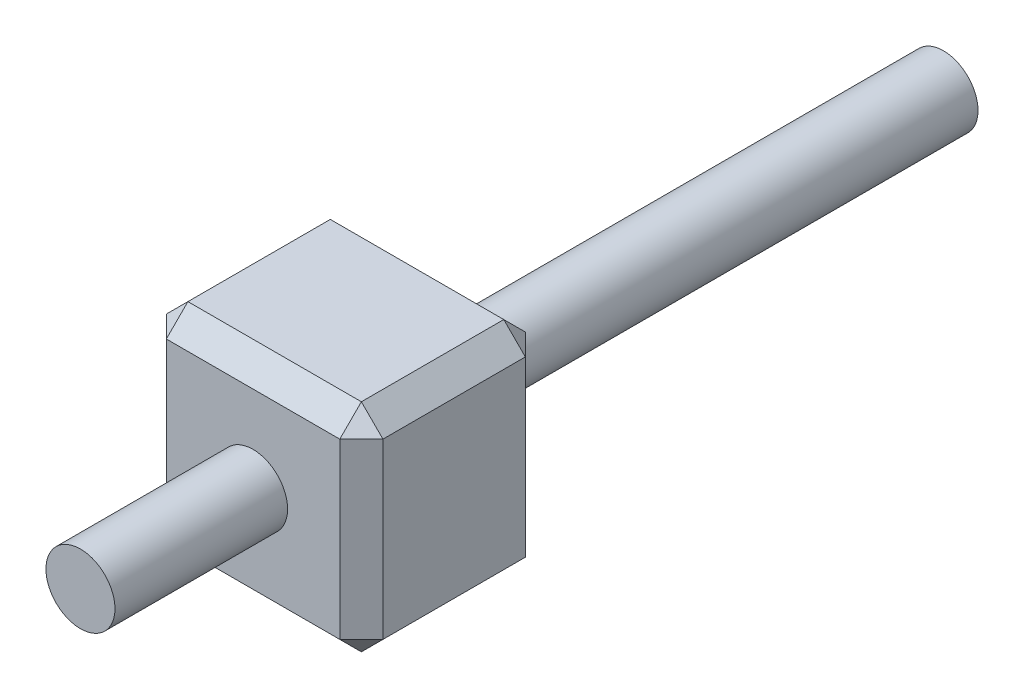
ISO-10303-21;
HEADER;
FILE_DESCRIPTION(('STEP AP214'),'2;1');
FILE_NAME('part.step','',(''),(''),'','','');
FILE_SCHEMA(('AUTOMOTIVE_DESIGN { 1 0 10303 214 1 1 1 1 }'));
ENDSEC;
DATA;
#1=APPLICATION_CONTEXT('core data for automotive mechanical design processes');
#2=APPLICATION_PROTOCOL_DEFINITION('international standard','automotive_design',2000,#1);
#3=PRODUCT_CONTEXT('',#1,'mechanical');
#4=PRODUCT('Part','Part','',(#3));
#5=PRODUCT_RELATED_PRODUCT_CATEGORY('part','',(#4));
#6=PRODUCT_DEFINITION_FORMATION('','',#4);
#7=PRODUCT_DEFINITION_CONTEXT('part definition',#1,'design');
#8=PRODUCT_DEFINITION('design','',#6,#7);
#9=PRODUCT_DEFINITION_SHAPE('','',#8);
#10=(LENGTH_UNIT() NAMED_UNIT(*) SI_UNIT(.MILLI.,.METRE.));
#11=(NAMED_UNIT(*) PLANE_ANGLE_UNIT() SI_UNIT($,.RADIAN.));
#12=(NAMED_UNIT(*) SI_UNIT($,.STERADIAN.) SOLID_ANGLE_UNIT());
#13=UNCERTAINTY_MEASURE_WITH_UNIT(LENGTH_MEASURE(1.E-05),#10,'distance_accuracy_value','');
#14=(GEOMETRIC_REPRESENTATION_CONTEXT(3) GLOBAL_UNCERTAINTY_ASSIGNED_CONTEXT((#13)) GLOBAL_UNIT_ASSIGNED_CONTEXT((#10,
#11,#12)) REPRESENTATION_CONTEXT('',''));
#15=CARTESIAN_POINT('',(0.,0.,0.));
#16=DIRECTION('',(0.,0.,1.));
#17=DIRECTION('',(1.,0.,0.));
#18=AXIS2_PLACEMENT_3D('',#15,#16,#17);
#19=CARTESIAN_POINT('',(-30.5004152134197,21.8097143331672,2.15));
#20=DIRECTION('',(0.,0.,1.));
#21=DIRECTION('',(1.,0.,0.));
#22=AXIS2_PLACEMENT_3D('',#19,#20,#21);
#23=PLANE('',#22);
#24=DIRECTION('',(-1.,0.,0.));
#25=VECTOR('',#24,1.);
#26=CARTESIAN_POINT('',(-30.5004152134197,24.0697143331672,2.15));
#27=LINE('',#26,#25);
#28=CARTESIAN_POINT('',(-28.2404152134197,24.0697143331672,2.15));
#29=VERTEX_POINT('',#28);
#30=CARTESIAN_POINT('',(-30.2504152134197,24.0697143331672,2.15));
#31=VERTEX_POINT('',#30);
#32=EDGE_CURVE('E118',#29,#31,#27,.T.);
#33=ORIENTED_EDGE('',*,*,#32,.T.);
#34=DIRECTION('',(0.,-1.,0.));
#35=VECTOR('',#34,1.);
#36=CARTESIAN_POINT('',(-30.2504152134197,21.8097143331672,2.15));
#37=LINE('',#36,#35);
#38=CARTESIAN_POINT('',(-30.2504152134197,22.0597143331672,2.15));
#39=VERTEX_POINT('',#38);
#40=EDGE_CURVE('E157',#31,#39,#37,.T.);
#41=ORIENTED_EDGE('',*,*,#40,.T.);
#42=DIRECTION('',(1.,0.,0.));
#43=VECTOR('',#42,1.);
#44=CARTESIAN_POINT('',(-27.9904152134197,22.0597143331672,2.15));
#45=LINE('',#44,#43);
#46=CARTESIAN_POINT('',(-28.2404152134197,22.0597143331672,2.15));
#47=VERTEX_POINT('',#46);
#48=EDGE_CURVE('E121',#39,#47,#45,.T.);
#49=ORIENTED_EDGE('',*,*,#48,.T.);
#50=DIRECTION('',(0.,1.,0.));
#51=VECTOR('',#50,1.);
#52=CARTESIAN_POINT('',(-28.2404152134197,24.3197143331672,2.15));
#53=LINE('',#52,#51);
#54=EDGE_CURVE('E113',#47,#29,#53,.T.);
#55=ORIENTED_EDGE('',*,*,#54,.T.);
#56=EDGE_LOOP('',(#33,#41,#49,#55));
#57=FACE_BOUND('',#56,.T.);
#58=CARTESIAN_POINT('',(-29.2454152134197,23.0647143331672,2.15));
#59=DIRECTION('',(0.,0.,1.));
#60=DIRECTION('',(1.,0.,0.));
#61=AXIS2_PLACEMENT_3D('',#58,#59,#60);
#62=CIRCLE('',#61,0.400000000000002);
#63=CARTESIAN_POINT('',(-28.8454152134197,23.0647143331672,2.15));
#64=VERTEX_POINT('',#63);
#65=EDGE_CURVE('E152',#64,#64,#62,.F.);
#66=ORIENTED_EDGE('',*,*,#65,.T.);
#67=EDGE_LOOP('',(#66));
#68=FACE_BOUND('',#67,.T.);
#69=ADVANCED_FACE('F28',(#57,#68),#23,.T.);
#70=CARTESIAN_POINT('',(-30.5004152134197,21.8097143331672,0.));
#71=DIRECTION('',(0.,0.,1.));
#72=DIRECTION('',(1.,0.,0.));
#73=AXIS2_PLACEMENT_3D('',#70,#71,#72);
#74=PLANE('',#73);
#75=DIRECTION('',(-1.,0.,0.));
#76=VECTOR('',#75,1.);
#77=CARTESIAN_POINT('',(-30.5004152134197,22.0597143331672,0.));
#78=LINE('',#77,#76);
#79=CARTESIAN_POINT('',(-28.2404152134197,22.0597143331672,0.));
#80=VERTEX_POINT('',#79);
#81=CARTESIAN_POINT('',(-30.2504152134197,22.0597143331672,0.));
#82=VERTEX_POINT('',#81);
#83=EDGE_CURVE('E172',#80,#82,#78,.T.);
#84=ORIENTED_EDGE('',*,*,#83,.T.);
#85=DIRECTION('',(0.,1.,0.));
#86=VECTOR('',#85,1.);
#87=CARTESIAN_POINT('',(-30.2504152134197,21.8097143331672,0.));
#88=LINE('',#87,#86);
#89=CARTESIAN_POINT('',(-30.2504152134197,24.0697143331672,0.));
#90=VERTEX_POINT('',#89);
#91=EDGE_CURVE('E174',#82,#90,#88,.T.);
#92=ORIENTED_EDGE('',*,*,#91,.T.);
#93=DIRECTION('',(1.,0.,0.));
#94=VECTOR('',#93,1.);
#95=CARTESIAN_POINT('',(-30.5004152134197,24.0697143331672,0.));
#96=LINE('',#95,#94);
#97=CARTESIAN_POINT('',(-28.2404152134197,24.0697143331672,0.));
#98=VERTEX_POINT('',#97);
#99=EDGE_CURVE('E168',#90,#98,#96,.T.);
#100=ORIENTED_EDGE('',*,*,#99,.T.);
#101=DIRECTION('',(0.,-1.,0.));
#102=VECTOR('',#101,1.);
#103=CARTESIAN_POINT('',(-28.2404152134197,21.8097143331672,0.));
#104=LINE('',#103,#102);
#105=EDGE_CURVE('E170',#98,#80,#104,.T.);
#106=ORIENTED_EDGE('',*,*,#105,.T.);
#107=EDGE_LOOP('',(#84,#92,#100,#106));
#108=FACE_BOUND('',#107,.T.);
#109=CARTESIAN_POINT('',(-29.2454152134197,23.0647143331672,0.));
#110=DIRECTION('',(0.,0.,1.));
#111=DIRECTION('',(1.,0.,0.));
#112=AXIS2_PLACEMENT_3D('',#109,#110,#111);
#113=CIRCLE('',#112,0.400000000000002);
#114=CARTESIAN_POINT('',(-28.8454152134197,23.0647143331672,0.));
#115=VERTEX_POINT('',#114);
#116=EDGE_CURVE('E149',#115,#115,#113,.F.);
#117=ORIENTED_EDGE('',*,*,#116,.F.);
#118=EDGE_LOOP('',(#117));
#119=FACE_BOUND('',#118,.T.);
#120=ADVANCED_FACE('F290',(#108,#119),#74,.F.);
#121=CARTESIAN_POINT('',(-30.5004152134197,24.3197143331672,2.15));
#122=DIRECTION('',(1.,0.,0.));
#123=DIRECTION('',(0.,0.,-1.));
#124=AXIS2_PLACEMENT_3D('',#121,#122,#123);
#125=PLANE('',#124);
#126=DIRECTION('',(0.,-1.,0.));
#127=VECTOR('',#126,1.);
#128=CARTESIAN_POINT('',(-30.5004152134197,24.3197143331672,0.25));
#129=LINE('',#128,#127);
#130=CARTESIAN_POINT('',(-30.5004152134197,24.0697143331672,0.25));
#131=VERTEX_POINT('',#130);
#132=CARTESIAN_POINT('',(-30.5004152134197,22.0597143331672,0.25));
#133=VERTEX_POINT('',#132);
#134=EDGE_CURVE('E161',#131,#133,#129,.T.);
#135=ORIENTED_EDGE('',*,*,#134,.T.);
#136=DIRECTION('',(0.,0.,1.));
#137=VECTOR('',#136,1.);
#138=CARTESIAN_POINT('',(-30.5004152134197,22.0597143331672,2.15));
#139=LINE('',#138,#137);
#140=CARTESIAN_POINT('',(-30.5004152134197,22.0597143331672,1.9));
#141=VERTEX_POINT('',#140);
#142=EDGE_CURVE('E166',#133,#141,#139,.T.);
#143=ORIENTED_EDGE('',*,*,#142,.T.);
#144=DIRECTION('',(0.,1.,0.));
#145=VECTOR('',#144,1.);
#146=CARTESIAN_POINT('',(-30.5004152134197,24.3197143331672,1.9));
#147=LINE('',#146,#145);
#148=CARTESIAN_POINT('',(-30.5004152134197,24.0697143331672,1.9));
#149=VERTEX_POINT('',#148);
#150=EDGE_CURVE('E163',#141,#149,#147,.T.);
#151=ORIENTED_EDGE('',*,*,#150,.T.);
#152=DIRECTION('',(0.,0.,-1.));
#153=VECTOR('',#152,1.);
#154=CARTESIAN_POINT('',(-30.5004152134197,24.0697143331672,2.15));
#155=LINE('',#154,#153);
#156=EDGE_CURVE('E159',#149,#131,#155,.T.);
#157=ORIENTED_EDGE('',*,*,#156,.T.);
#158=EDGE_LOOP('',(#135,#143,#151,#157));
#159=FACE_BOUND('',#158,.T.);
#160=ADVANCED_FACE('F30',(#159),#125,.F.);
#161=CARTESIAN_POINT('',(-30.5004152134197,21.8097143331672,2.15));
#162=DIRECTION('',(0.,1.,0.));
#163=DIRECTION('',(0.,0.,1.));
#164=AXIS2_PLACEMENT_3D('',#161,#162,#163);
#165=PLANE('',#164);
#166=DIRECTION('',(-1.,0.,0.));
#167=VECTOR('',#166,1.);
#168=CARTESIAN_POINT('',(-30.5004152134197,21.8097143331672,1.9));
#169=LINE('',#168,#167);
#170=CARTESIAN_POINT('',(-28.2404152134197,21.8097143331672,1.9));
#171=VERTEX_POINT('',#170);
#172=CARTESIAN_POINT('',(-30.2504152134197,21.8097143331672,1.9));
#173=VERTEX_POINT('',#172);
#174=EDGE_CURVE('E181',#171,#173,#169,.T.);
#175=ORIENTED_EDGE('',*,*,#174,.T.);
#176=DIRECTION('',(0.,0.,-1.));
#177=VECTOR('',#176,1.);
#178=CARTESIAN_POINT('',(-30.2504152134197,21.8097143331672,2.15));
#179=LINE('',#178,#177);
#180=CARTESIAN_POINT('',(-30.2504152134197,21.8097143331672,0.25));
#181=VERTEX_POINT('',#180);
#182=EDGE_CURVE('E183',#173,#181,#179,.T.);
#183=ORIENTED_EDGE('',*,*,#182,.T.);
#184=DIRECTION('',(1.,0.,0.));
#185=VECTOR('',#184,1.);
#186=CARTESIAN_POINT('',(-30.5004152134197,21.8097143331672,0.25));
#187=LINE('',#186,#185);
#188=CARTESIAN_POINT('',(-28.2404152134197,21.8097143331672,0.25));
#189=VERTEX_POINT('',#188);
#190=EDGE_CURVE('E179',#181,#189,#187,.T.);
#191=ORIENTED_EDGE('',*,*,#190,.T.);
#192=DIRECTION('',(0.,0.,1.));
#193=VECTOR('',#192,1.);
#194=CARTESIAN_POINT('',(-28.2404152134197,21.8097143331672,2.15));
#195=LINE('',#194,#193);
#196=EDGE_CURVE('E177',#189,#171,#195,.T.);
#197=ORIENTED_EDGE('',*,*,#196,.T.);
#198=EDGE_LOOP('',(#175,#183,#191,#197));
#199=FACE_BOUND('',#198,.T.);
#200=ADVANCED_FACE('F303',(#199),#165,.F.);
#201=CARTESIAN_POINT('',(-27.9904152134197,24.3197143331672,2.15));
#202=DIRECTION('',(-1.,0.,0.));
#203=DIRECTION('',(0.,-1.,0.));
#204=AXIS2_PLACEMENT_3D('',#201,#202,#203);
#205=PLANE('',#204);
#206=DIRECTION('',(0.,-1.,0.));
#207=VECTOR('',#206,1.);
#208=CARTESIAN_POINT('',(-27.9904152134197,21.8097143331672,1.9));
#209=LINE('',#208,#207);
#210=CARTESIAN_POINT('',(-27.9904152134197,24.0697143331672,1.9));
#211=VERTEX_POINT('',#210);
#212=CARTESIAN_POINT('',(-27.9904152134197,22.0597143331672,1.9));
#213=VERTEX_POINT('',#212);
#214=EDGE_CURVE('E131',#211,#213,#209,.T.);
#215=ORIENTED_EDGE('',*,*,#214,.T.);
#216=DIRECTION('',(0.,0.,-1.));
#217=VECTOR('',#216,1.);
#218=CARTESIAN_POINT('',(-27.9904152134197,22.0597143331672,2.15));
#219=LINE('',#218,#217);
#220=CARTESIAN_POINT('',(-27.9904152134197,22.0597143331672,0.25));
#221=VERTEX_POINT('',#220);
#222=EDGE_CURVE('E191',#213,#221,#219,.T.);
#223=ORIENTED_EDGE('',*,*,#222,.T.);
#224=DIRECTION('',(0.,1.,0.));
#225=VECTOR('',#224,1.);
#226=CARTESIAN_POINT('',(-27.9904152134197,24.3197143331672,0.25));
#227=LINE('',#226,#225);
#228=CARTESIAN_POINT('',(-27.9904152134197,24.0697143331672,0.25));
#229=VERTEX_POINT('',#228);
#230=EDGE_CURVE('E188',#221,#229,#227,.T.);
#231=ORIENTED_EDGE('',*,*,#230,.T.);
#232=DIRECTION('',(0.,0.,1.));
#233=VECTOR('',#232,1.);
#234=CARTESIAN_POINT('',(-27.9904152134197,24.0697143331672,2.15));
#235=LINE('',#234,#233);
#236=EDGE_CURVE('E186',#229,#211,#235,.T.);
#237=ORIENTED_EDGE('',*,*,#236,.T.);
#238=EDGE_LOOP('',(#215,#223,#231,#237));
#239=FACE_BOUND('',#238,.T.);
#240=ADVANCED_FACE('F301',(#239),#205,.F.);
#241=CARTESIAN_POINT('',(-30.5004152134197,24.3197143331672,2.15));
#242=DIRECTION('',(0.,-1.,0.));
#243=DIRECTION('',(0.,0.,-1.));
#244=AXIS2_PLACEMENT_3D('',#241,#242,#243);
#245=PLANE('',#244);
#246=DIRECTION('',(1.,0.,0.));
#247=VECTOR('',#246,1.);
#248=CARTESIAN_POINT('',(-27.9904152134197,24.3197143331672,1.9));
#249=LINE('',#248,#247);
#250=CARTESIAN_POINT('',(-30.2504152134197,24.3197143331672,1.9));
#251=VERTEX_POINT('',#250);
#252=CARTESIAN_POINT('',(-28.2404152134197,24.3197143331672,1.9));
#253=VERTEX_POINT('',#252);
#254=EDGE_CURVE('E36',#251,#253,#249,.T.);
#255=ORIENTED_EDGE('',*,*,#254,.T.);
#256=DIRECTION('',(0.,0.,-1.));
#257=VECTOR('',#256,1.);
#258=CARTESIAN_POINT('',(-28.2404152134197,24.3197143331672,2.15));
#259=LINE('',#258,#257);
#260=CARTESIAN_POINT('',(-28.2404152134197,24.3197143331672,0.25));
#261=VERTEX_POINT('',#260);
#262=EDGE_CURVE('E11',#253,#261,#259,.T.);
#263=ORIENTED_EDGE('',*,*,#262,.T.);
#264=DIRECTION('',(-1.,0.,0.));
#265=VECTOR('',#264,1.);
#266=CARTESIAN_POINT('',(-30.5004152134197,24.3197143331672,0.25));
#267=LINE('',#266,#265);
#268=CARTESIAN_POINT('',(-30.2504152134197,24.3197143331672,0.25));
#269=VERTEX_POINT('',#268);
#270=EDGE_CURVE('E194',#261,#269,#267,.T.);
#271=ORIENTED_EDGE('',*,*,#270,.T.);
#272=DIRECTION('',(0.,0.,1.));
#273=VECTOR('',#272,1.);
#274=CARTESIAN_POINT('',(-30.2504152134197,24.3197143331672,2.15));
#275=LINE('',#274,#273);
#276=EDGE_CURVE('E46',#269,#251,#275,.T.);
#277=ORIENTED_EDGE('',*,*,#276,.T.);
#278=EDGE_LOOP('',(#255,#263,#271,#277));
#279=FACE_BOUND('',#278,.T.);
#280=ADVANCED_FACE('F197',(#279),#245,.F.);
#281=CARTESIAN_POINT('',(-29.2454152134197,23.0647143331672,-5.85));
#282=DIRECTION('',(0.,0.,1.));
#283=DIRECTION('',(1.,0.,0.));
#284=AXIS2_PLACEMENT_3D('',#281,#282,#283);
#285=PLANE('',#284);
#286=CARTESIAN_POINT('',(-29.2454152134197,23.0647143331672,-5.85));
#287=DIRECTION('',(0.,0.,1.));
#288=DIRECTION('',(1.,0.,0.));
#289=AXIS2_PLACEMENT_3D('',#286,#287,#288);
#290=CIRCLE('',#289,0.400000000000002);
#291=CARTESIAN_POINT('',(-28.8454152134197,23.0647143331672,-5.85));
#292=VERTEX_POINT('',#291);
#293=EDGE_CURVE('E263',#292,#292,#290,.T.);
#294=ORIENTED_EDGE('',*,*,#293,.F.);
#295=EDGE_LOOP('',(#294));
#296=FACE_BOUND('',#295,.T.);
#297=ADVANCED_FACE('F300',(#296),#285,.F.);
#298=CARTESIAN_POINT('',(-29.2454152134197,23.0647143331672,4.15));
#299=DIRECTION('',(0.,0.,-1.));
#300=DIRECTION('',(-1.,0.,0.));
#301=AXIS2_PLACEMENT_3D('',#298,#299,#300);
#302=CYLINDRICAL_SURFACE('',#301,0.400000000000002);
#303=ORIENTED_EDGE('',*,*,#293,.T.);
#304=EDGE_LOOP('',(#303));
#305=FACE_BOUND('',#304,.T.);
#306=ORIENTED_EDGE('',*,*,#116,.T.);
#307=EDGE_LOOP('',(#306));
#308=FACE_BOUND('',#307,.T.);
#309=ADVANCED_FACE('F275',(#305,#308),#302,.T.);
#310=ORIENTED_EDGE('',*,*,#65,.F.);
#311=EDGE_LOOP('',(#310));
#312=FACE_BOUND('',#311,.T.);
#313=CARTESIAN_POINT('',(-29.2454152134197,23.0647143331672,4.15));
#314=DIRECTION('',(0.,0.,1.));
#315=DIRECTION('',(1.,0.,0.));
#316=AXIS2_PLACEMENT_3D('',#313,#314,#315);
#317=CIRCLE('',#316,0.400000000000002);
#318=CARTESIAN_POINT('',(-28.8454152134197,23.0647143331672,4.15));
#319=VERTEX_POINT('',#318);
#320=EDGE_CURVE('E266',#319,#319,#317,.T.);
#321=ORIENTED_EDGE('',*,*,#320,.F.);
#322=EDGE_LOOP('',(#321));
#323=FACE_BOUND('',#322,.T.);
#324=ADVANCED_FACE('F271',(#312,#323),#302,.T.);
#325=CARTESIAN_POINT('',(-29.2454152134197,23.0647143331672,4.15));
#326=DIRECTION('',(0.,0.,1.));
#327=DIRECTION('',(1.,0.,0.));
#328=AXIS2_PLACEMENT_3D('',#325,#326,#327);
#329=PLANE('',#328);
#330=ORIENTED_EDGE('',*,*,#320,.T.);
#331=EDGE_LOOP('',(#330));
#332=FACE_BOUND('',#331,.T.);
#333=ADVANCED_FACE('F274',(#332),#329,.T.);
#334=CARTESIAN_POINT('',(-27.9904152134197,24.3197143331672,0.25));
#335=DIRECTION('',(-0.707106781186547,0.,0.707106781186547));
#336=DIRECTION('',(0.707106781186548,0.,0.707106781186548));
#337=AXIS2_PLACEMENT_3D('',#334,#335,#336);
#338=PLANE('',#337);
#339=DIRECTION('',(0.707106781186548,0.,0.707106781186548));
#340=VECTOR('',#339,1.);
#341=CARTESIAN_POINT('',(-27.9904152134197,24.0697143331672,0.25));
#342=LINE('',#341,#340);
#343=EDGE_CURVE('E260',#229,#98,#342,.F.);
#344=ORIENTED_EDGE('',*,*,#343,.F.);
#345=ORIENTED_EDGE('',*,*,#230,.F.);
#346=DIRECTION('',(-0.707106781186547,0.,-0.707106781186547));
#347=VECTOR('',#346,1.);
#348=CARTESIAN_POINT('',(-28.1154152134197,22.0597143331672,0.125));
#349=LINE('',#348,#347);
#350=EDGE_CURVE('E257',#80,#221,#349,.F.);
#351=ORIENTED_EDGE('',*,*,#350,.F.);
#352=ORIENTED_EDGE('',*,*,#105,.F.);
#353=EDGE_LOOP('',(#344,#345,#351,#352));
#354=FACE_BOUND('',#353,.T.);
#355=ADVANCED_FACE('F280',(#354),#338,.F.);
#356=CARTESIAN_POINT('',(-27.9904152134197,24.0697143331672,0.25));
#357=DIRECTION('',(0.577350269189626,0.577350269189626,-0.577350269189626));
#358=DIRECTION('',(-0.707106781186547,0.,-0.707106781186547));
#359=AXIS2_PLACEMENT_3D('',#356,#357,#358);
#360=PLANE('',#359);
#361=DIRECTION('',(-0.707106781186547,0.707106781186547,0.));
#362=VECTOR('',#361,1.);
#363=CARTESIAN_POINT('',(-27.9904152134197,24.0697143331672,0.25));
#364=LINE('',#363,#362);
#365=EDGE_CURVE('E252',#229,#261,#364,.T.);
#366=ORIENTED_EDGE('',*,*,#365,.F.);
#367=ORIENTED_EDGE('',*,*,#343,.T.);
#368=DIRECTION('',(0.,-0.707106781186547,-0.707106781186547));
#369=VECTOR('',#368,1.);
#370=CARTESIAN_POINT('',(-28.2404152134197,24.1947143331672,0.125));
#371=LINE('',#370,#369);
#372=EDGE_CURVE('E255',#261,#98,#371,.T.);
#373=ORIENTED_EDGE('',*,*,#372,.F.);
#374=EDGE_LOOP('',(#366,#367,#373));
#375=FACE_BOUND('',#374,.T.);
#376=ADVANCED_FACE('F286',(#375),#360,.T.);
#377=CARTESIAN_POINT('',(-28.2404152134197,21.8097143331672,0.25));
#378=DIRECTION('',(0.577350269189626,-0.577350269189626,-0.577350269189626));
#379=DIRECTION('',(-0.707106781186547,0.,-0.707106781186547));
#380=AXIS2_PLACEMENT_3D('',#377,#378,#379);
#381=PLANE('',#380);
#382=DIRECTION('',(0.,-0.707106781186547,0.707106781186547));
#383=VECTOR('',#382,1.);
#384=CARTESIAN_POINT('',(-28.2404152134197,21.8097143331672,0.25));
#385=LINE('',#384,#383);
#386=EDGE_CURVE('E247',#80,#189,#385,.T.);
#387=ORIENTED_EDGE('',*,*,#386,.F.);
#388=ORIENTED_EDGE('',*,*,#350,.T.);
#389=DIRECTION('',(0.707106781186547,0.707106781186547,0.));
#390=VECTOR('',#389,1.);
#391=CARTESIAN_POINT('',(-28.2404152134197,21.8097143331672,0.25));
#392=LINE('',#391,#390);
#393=EDGE_CURVE('E250',#189,#221,#392,.T.);
#394=ORIENTED_EDGE('',*,*,#393,.F.);
#395=EDGE_LOOP('',(#387,#388,#394));
#396=FACE_BOUND('',#395,.T.);
#397=ADVANCED_FACE('F348',(#396),#381,.T.);
#398=CARTESIAN_POINT('',(-30.5004152134197,24.3197143331672,0.25));
#399=DIRECTION('',(0.,-0.707106781186547,0.707106781186547));
#400=DIRECTION('',(0.,-0.707106781186548,-0.707106781186548));
#401=AXIS2_PLACEMENT_3D('',#398,#399,#400);
#402=PLANE('',#401);
#403=ORIENTED_EDGE('',*,*,#372,.T.);
#404=ORIENTED_EDGE('',*,*,#99,.F.);
#405=DIRECTION('',(0.,0.707106781186547,0.707106781186547));
#406=VECTOR('',#405,1.);
#407=CARTESIAN_POINT('',(-30.2504152134197,24.0697143331672,0.));
#408=LINE('',#407,#406);
#409=EDGE_CURVE('E202',#269,#90,#408,.F.);
#410=ORIENTED_EDGE('',*,*,#409,.F.);
#411=ORIENTED_EDGE('',*,*,#270,.F.);
#412=EDGE_LOOP('',(#403,#404,#410,#411));
#413=FACE_BOUND('',#412,.T.);
#414=ADVANCED_FACE('F204',(#413),#402,.F.);
#415=CARTESIAN_POINT('',(-28.2404152134197,24.3197143331672,2.15));
#416=DIRECTION('',(-0.707106781186547,-0.707106781186547,0.));
#417=DIRECTION('',(0.707106781186548,-0.707106781186548,0.));
#418=AXIS2_PLACEMENT_3D('',#415,#416,#417);
#419=PLANE('',#418);
#420=ORIENTED_EDGE('',*,*,#365,.T.);
#421=ORIENTED_EDGE('',*,*,#262,.F.);
#422=DIRECTION('',(0.707106781186547,-0.707106781186547,0.));
#423=VECTOR('',#422,1.);
#424=CARTESIAN_POINT('',(-28.1154152134197,24.1947143331672,1.9));
#425=LINE('',#424,#423);
#426=EDGE_CURVE('E135',#211,#253,#425,.F.);
#427=ORIENTED_EDGE('',*,*,#426,.F.);
#428=ORIENTED_EDGE('',*,*,#236,.F.);
#429=EDGE_LOOP('',(#420,#421,#427,#428));
#430=FACE_BOUND('',#429,.T.);
#431=ADVANCED_FACE('F377',(#430),#419,.F.);
#432=CARTESIAN_POINT('',(-28.2404152134197,21.8097143331672,2.15));
#433=DIRECTION('',(0.707106781186547,0.,0.707106781186547));
#434=DIRECTION('',(0.707106781186548,0.,-0.707106781186548));
#435=AXIS2_PLACEMENT_3D('',#432,#433,#434);
#436=PLANE('',#435);
#437=DIRECTION('',(-0.707106781186547,0.,0.707106781186547));
#438=VECTOR('',#437,1.);
#439=CARTESIAN_POINT('',(-28.2404152134197,22.0597143331672,2.15));
#440=LINE('',#439,#438);
#441=EDGE_CURVE('E136',#213,#47,#440,.T.);
#442=ORIENTED_EDGE('',*,*,#441,.F.);
#443=ORIENTED_EDGE('',*,*,#214,.F.);
#444=DIRECTION('',(0.707106781186548,0.,-0.707106781186548));
#445=VECTOR('',#444,1.);
#446=CARTESIAN_POINT('',(-28.2404152134197,24.0697143331672,2.15));
#447=LINE('',#446,#445);
#448=EDGE_CURVE('E128',#29,#211,#447,.T.);
#449=ORIENTED_EDGE('',*,*,#448,.F.);
#450=ORIENTED_EDGE('',*,*,#54,.F.);
#451=EDGE_LOOP('',(#442,#443,#449,#450));
#452=FACE_BOUND('',#451,.T.);
#453=ADVANCED_FACE('F130',(#452),#436,.T.);
#454=CARTESIAN_POINT('',(-27.9904152134197,22.0597143331672,2.15));
#455=DIRECTION('',(-0.707106781186547,0.707106781186547,0.));
#456=DIRECTION('',(-0.707106781186548,-0.707106781186548,0.));
#457=AXIS2_PLACEMENT_3D('',#454,#455,#456);
#458=PLANE('',#457);
#459=ORIENTED_EDGE('',*,*,#393,.T.);
#460=ORIENTED_EDGE('',*,*,#222,.F.);
#461=DIRECTION('',(-0.707106781186547,-0.707106781186547,0.));
#462=VECTOR('',#461,1.);
#463=CARTESIAN_POINT('',(-28.1154152134197,21.9347143331672,1.9));
#464=LINE('',#463,#462);
#465=EDGE_CURVE('E241',#171,#213,#464,.F.);
#466=ORIENTED_EDGE('',*,*,#465,.F.);
#467=ORIENTED_EDGE('',*,*,#196,.F.);
#468=EDGE_LOOP('',(#459,#460,#466,#467));
#469=FACE_BOUND('',#468,.T.);
#470=ADVANCED_FACE('F353',(#469),#458,.F.);
#471=CARTESIAN_POINT('',(-30.5004152134197,21.8097143331672,0.25));
#472=DIRECTION('',(0.,0.707106781186547,0.707106781186547));
#473=DIRECTION('',(0.,-0.707106781186548,0.707106781186548));
#474=AXIS2_PLACEMENT_3D('',#471,#472,#473);
#475=PLANE('',#474);
#476=ORIENTED_EDGE('',*,*,#386,.T.);
#477=ORIENTED_EDGE('',*,*,#190,.F.);
#478=DIRECTION('',(0.,0.707106781186547,-0.707106781186547));
#479=VECTOR('',#478,1.);
#480=CARTESIAN_POINT('',(-30.2504152134197,21.9347143331672,0.125));
#481=LINE('',#480,#479);
#482=EDGE_CURVE('E238',#82,#181,#481,.F.);
#483=ORIENTED_EDGE('',*,*,#482,.F.);
#484=ORIENTED_EDGE('',*,*,#83,.F.);
#485=EDGE_LOOP('',(#476,#477,#483,#484));
#486=FACE_BOUND('',#485,.T.);
#487=ADVANCED_FACE('F344',(#486),#475,.F.);
#488=CARTESIAN_POINT('',(-30.5004152134197,24.3197143331672,0.25));
#489=DIRECTION('',(0.707106781186547,0.,0.707106781186547));
#490=DIRECTION('',(0.707106781186548,0.,-0.707106781186548));
#491=AXIS2_PLACEMENT_3D('',#488,#489,#490);
#492=PLANE('',#491);
#493=DIRECTION('',(0.707106781186547,0.,-0.707106781186547));
#494=VECTOR('',#493,1.);
#495=CARTESIAN_POINT('',(-30.2504152134197,24.0697143331672,0.));
#496=LINE('',#495,#494);
#497=EDGE_CURVE('E208',#90,#131,#496,.F.);
#498=ORIENTED_EDGE('',*,*,#497,.F.);
#499=ORIENTED_EDGE('',*,*,#91,.F.);
#500=DIRECTION('',(-0.707106781186547,0.,0.707106781186547));
#501=VECTOR('',#500,1.);
#502=CARTESIAN_POINT('',(-30.5004152134197,22.0597143331672,0.25));
#503=LINE('',#502,#501);
#504=EDGE_CURVE('E214',#133,#82,#503,.F.);
#505=ORIENTED_EDGE('',*,*,#504,.F.);
#506=ORIENTED_EDGE('',*,*,#134,.F.);
#507=EDGE_LOOP('',(#498,#499,#505,#506));
#508=FACE_BOUND('',#507,.T.);
#509=ADVANCED_FACE('F337',(#508),#492,.F.);
#510=CARTESIAN_POINT('',(-30.2504152134197,24.0697143331672,0.));
#511=DIRECTION('',(-0.577350269189626,0.577350269189626,-0.577350269189626));
#512=DIRECTION('',(-0.707106781186547,0.,0.707106781186547));
#513=AXIS2_PLACEMENT_3D('',#510,#511,#512);
#514=PLANE('',#513);
#515=ORIENTED_EDGE('',*,*,#409,.T.);
#516=ORIENTED_EDGE('',*,*,#497,.T.);
#517=DIRECTION('',(-0.707106781186547,-0.707106781186547,0.));
#518=VECTOR('',#517,1.);
#519=CARTESIAN_POINT('',(-30.3754152134197,24.1947143331672,0.25));
#520=LINE('',#519,#518);
#521=EDGE_CURVE('E142',#269,#131,#520,.T.);
#522=ORIENTED_EDGE('',*,*,#521,.F.);
#523=EDGE_LOOP('',(#515,#516,#522));
#524=FACE_BOUND('',#523,.T.);
#525=ADVANCED_FACE('F211',(#524),#514,.T.);
#526=CARTESIAN_POINT('',(-28.2404152134197,24.0697143331672,2.15));
#527=DIRECTION('',(0.577350269189626,0.577350269189626,0.577350269189626));
#528=DIRECTION('',(0.707106781186547,0.,-0.707106781186547));
#529=AXIS2_PLACEMENT_3D('',#526,#527,#528);
#530=PLANE('',#529);
#531=ORIENTED_EDGE('',*,*,#448,.T.);
#532=ORIENTED_EDGE('',*,*,#426,.T.);
#533=DIRECTION('',(0.,-0.707106781186547,0.707106781186547));
#534=VECTOR('',#533,1.);
#535=CARTESIAN_POINT('',(-28.2404152134197,24.0697143331672,2.15));
#536=LINE('',#535,#534);
#537=EDGE_CURVE('E139',#29,#253,#536,.F.);
#538=ORIENTED_EDGE('',*,*,#537,.F.);
#539=EDGE_LOOP('',(#531,#532,#538));
#540=FACE_BOUND('',#539,.T.);
#541=ADVANCED_FACE('F140',(#540),#530,.T.);
#542=CARTESIAN_POINT('',(-28.2404152134197,22.0597143331672,2.15));
#543=DIRECTION('',(0.577350269189626,-0.577350269189626,0.577350269189626));
#544=DIRECTION('',(0.707106781186547,0.,-0.707106781186547));
#545=AXIS2_PLACEMENT_3D('',#542,#543,#544);
#546=PLANE('',#545);
#547=ORIENTED_EDGE('',*,*,#465,.T.);
#548=ORIENTED_EDGE('',*,*,#441,.T.);
#549=DIRECTION('',(0.,-0.707106781186547,-0.707106781186547));
#550=VECTOR('',#549,1.);
#551=CARTESIAN_POINT('',(-28.2404152134197,22.0597143331672,2.15));
#552=LINE('',#551,#550);
#553=EDGE_CURVE('E143',#171,#47,#552,.F.);
#554=ORIENTED_EDGE('',*,*,#553,.F.);
#555=EDGE_LOOP('',(#547,#548,#554));
#556=FACE_BOUND('',#555,.T.);
#557=ADVANCED_FACE('F356',(#556),#546,.T.);
#558=CARTESIAN_POINT('',(-30.5004152134197,22.0597143331672,0.25));
#559=DIRECTION('',(-0.577350269189626,-0.577350269189626,-0.577350269189626));
#560=DIRECTION('',(-0.707106781186547,0.,0.707106781186547));
#561=AXIS2_PLACEMENT_3D('',#558,#559,#560);
#562=PLANE('',#561);
#563=ORIENTED_EDGE('',*,*,#504,.T.);
#564=ORIENTED_EDGE('',*,*,#482,.T.);
#565=DIRECTION('',(0.707106781186547,-0.707106781186547,0.));
#566=VECTOR('',#565,1.);
#567=CARTESIAN_POINT('',(-30.5004152134197,22.0597143331672,0.25));
#568=LINE('',#567,#566);
#569=EDGE_CURVE('E221',#133,#181,#568,.T.);
#570=ORIENTED_EDGE('',*,*,#569,.F.);
#571=EDGE_LOOP('',(#563,#564,#570));
#572=FACE_BOUND('',#571,.T.);
#573=ADVANCED_FACE('F340',(#572),#562,.T.);
#574=CARTESIAN_POINT('',(-30.5004152134197,24.0697143331672,2.15));
#575=DIRECTION('',(0.707106781186547,-0.707106781186547,0.));
#576=DIRECTION('',(0.707106781186548,0.707106781186548,0.));
#577=AXIS2_PLACEMENT_3D('',#574,#575,#576);
#578=PLANE('',#577);
#579=ORIENTED_EDGE('',*,*,#521,.T.);
#580=ORIENTED_EDGE('',*,*,#156,.F.);
#581=DIRECTION('',(0.707106781186547,0.707106781186547,0.));
#582=VECTOR('',#581,1.);
#583=CARTESIAN_POINT('',(-30.5004152134197,24.0697143331672,1.9));
#584=LINE('',#583,#582);
#585=EDGE_CURVE('E219',#251,#149,#584,.F.);
#586=ORIENTED_EDGE('',*,*,#585,.F.);
#587=ORIENTED_EDGE('',*,*,#276,.F.);
#588=EDGE_LOOP('',(#579,#580,#586,#587));
#589=FACE_BOUND('',#588,.T.);
#590=ADVANCED_FACE('F217',(#589),#578,.F.);
#591=CARTESIAN_POINT('',(-30.5004152134197,24.0697143331672,2.15));
#592=DIRECTION('',(0.,0.707106781186547,0.707106781186547));
#593=DIRECTION('',(0.,-0.707106781186548,0.707106781186548));
#594=AXIS2_PLACEMENT_3D('',#591,#592,#593);
#595=PLANE('',#594);
#596=ORIENTED_EDGE('',*,*,#537,.T.);
#597=ORIENTED_EDGE('',*,*,#254,.F.);
#598=DIRECTION('',(0.,0.707106781186547,-0.707106781186547));
#599=VECTOR('',#598,1.);
#600=CARTESIAN_POINT('',(-30.2504152134197,24.1947143331672,2.025));
#601=LINE('',#600,#599);
#602=EDGE_CURVE('E147',#31,#251,#601,.T.);
#603=ORIENTED_EDGE('',*,*,#602,.F.);
#604=ORIENTED_EDGE('',*,*,#32,.F.);
#605=EDGE_LOOP('',(#596,#597,#603,#604));
#606=FACE_BOUND('',#605,.T.);
#607=ADVANCED_FACE('F145',(#606),#595,.T.);
#608=CARTESIAN_POINT('',(-30.5004152134197,22.0597143331672,2.15));
#609=DIRECTION('',(0.,-0.707106781186547,0.707106781186547));
#610=DIRECTION('',(0.,-0.707106781186548,-0.707106781186548));
#611=AXIS2_PLACEMENT_3D('',#608,#609,#610);
#612=PLANE('',#611);
#613=ORIENTED_EDGE('',*,*,#553,.T.);
#614=ORIENTED_EDGE('',*,*,#48,.F.);
#615=DIRECTION('',(0.,0.707106781186547,0.707106781186547));
#616=VECTOR('',#615,1.);
#617=CARTESIAN_POINT('',(-30.2504152134197,22.0597143331672,2.15));
#618=LINE('',#617,#616);
#619=EDGE_CURVE('E226',#173,#39,#618,.T.);
#620=ORIENTED_EDGE('',*,*,#619,.F.);
#621=ORIENTED_EDGE('',*,*,#174,.F.);
#622=EDGE_LOOP('',(#613,#614,#620,#621));
#623=FACE_BOUND('',#622,.T.);
#624=ADVANCED_FACE('F324',(#623),#612,.T.);
#625=CARTESIAN_POINT('',(-30.2504152134197,21.8097143331672,2.15));
#626=DIRECTION('',(0.707106781186547,0.707106781186547,0.));
#627=DIRECTION('',(-0.707106781186548,0.707106781186548,0.));
#628=AXIS2_PLACEMENT_3D('',#625,#626,#627);
#629=PLANE('',#628);
#630=ORIENTED_EDGE('',*,*,#569,.T.);
#631=ORIENTED_EDGE('',*,*,#182,.F.);
#632=DIRECTION('',(-0.707106781186547,0.707106781186547,0.));
#633=VECTOR('',#632,1.);
#634=CARTESIAN_POINT('',(-30.3754152134197,21.9347143331672,1.9));
#635=LINE('',#634,#633);
#636=EDGE_CURVE('E229',#141,#173,#635,.F.);
#637=ORIENTED_EDGE('',*,*,#636,.F.);
#638=ORIENTED_EDGE('',*,*,#142,.F.);
#639=EDGE_LOOP('',(#630,#631,#637,#638));
#640=FACE_BOUND('',#639,.T.);
#641=ADVANCED_FACE('F319',(#640),#629,.F.);
#642=CARTESIAN_POINT('',(-30.5004152134197,24.0697143331672,1.9));
#643=DIRECTION('',(-0.577350269189626,0.577350269189626,0.577350269189626));
#644=DIRECTION('',(0.707106781186547,0.,0.707106781186547));
#645=AXIS2_PLACEMENT_3D('',#642,#643,#644);
#646=PLANE('',#645);
#647=ORIENTED_EDGE('',*,*,#602,.T.);
#648=ORIENTED_EDGE('',*,*,#585,.T.);
#649=DIRECTION('',(0.707106781186547,0.,0.707106781186547));
#650=VECTOR('',#649,1.);
#651=CARTESIAN_POINT('',(-30.5004152134197,24.0697143331672,1.9));
#652=LINE('',#651,#650);
#653=EDGE_CURVE('E224',#31,#149,#652,.F.);
#654=ORIENTED_EDGE('',*,*,#653,.F.);
#655=EDGE_LOOP('',(#647,#648,#654));
#656=FACE_BOUND('',#655,.T.);
#657=ADVANCED_FACE('F223',(#656),#646,.T.);
#658=CARTESIAN_POINT('',(-30.2504152134197,22.0597143331672,2.15));
#659=DIRECTION('',(-0.577350269189626,-0.577350269189626,0.577350269189626));
#660=DIRECTION('',(0.707106781186547,0.,0.707106781186547));
#661=AXIS2_PLACEMENT_3D('',#658,#659,#660);
#662=PLANE('',#661);
#663=ORIENTED_EDGE('',*,*,#636,.T.);
#664=ORIENTED_EDGE('',*,*,#619,.T.);
#665=DIRECTION('',(-0.707106781186547,0.,-0.707106781186547));
#666=VECTOR('',#665,1.);
#667=CARTESIAN_POINT('',(-30.2504152134197,22.0597143331672,2.15));
#668=LINE('',#667,#666);
#669=EDGE_CURVE('E328',#141,#39,#668,.F.);
#670=ORIENTED_EDGE('',*,*,#669,.F.);
#671=EDGE_LOOP('',(#663,#664,#670));
#672=FACE_BOUND('',#671,.T.);
#673=ADVANCED_FACE('F327',(#672),#662,.T.);
#674=CARTESIAN_POINT('',(-30.2504152134197,21.8097143331672,2.15));
#675=DIRECTION('',(-0.707106781186547,0.,0.707106781186547));
#676=DIRECTION('',(0.707106781186548,0.,0.707106781186548));
#677=AXIS2_PLACEMENT_3D('',#674,#675,#676);
#678=PLANE('',#677);
#679=ORIENTED_EDGE('',*,*,#653,.T.);
#680=ORIENTED_EDGE('',*,*,#150,.F.);
#681=ORIENTED_EDGE('',*,*,#669,.T.);
#682=ORIENTED_EDGE('',*,*,#40,.F.);
#683=EDGE_LOOP('',(#679,#680,#681,#682));
#684=FACE_BOUND('',#683,.T.);
#685=ADVANCED_FACE('F332',(#684),#678,.T.);
#686=CLOSED_SHELL('',(#69,#120,#160,#200,#240,#280,#297,#309,#324,#333,#355,#376,#397,#414,#431,
#453,#470,#487,#509,#525,#541,#557,#573,#590,#607,#624,#641,#657,#673,#685));
#687=MANIFOLD_SOLID_BREP('B2',#686);
#688=ADVANCED_BREP_SHAPE_REPRESENTATION('',(#18,#687),#14);
#689=SHAPE_DEFINITION_REPRESENTATION(#9,#688);
ENDSEC;
END-ISO-10303-21;
